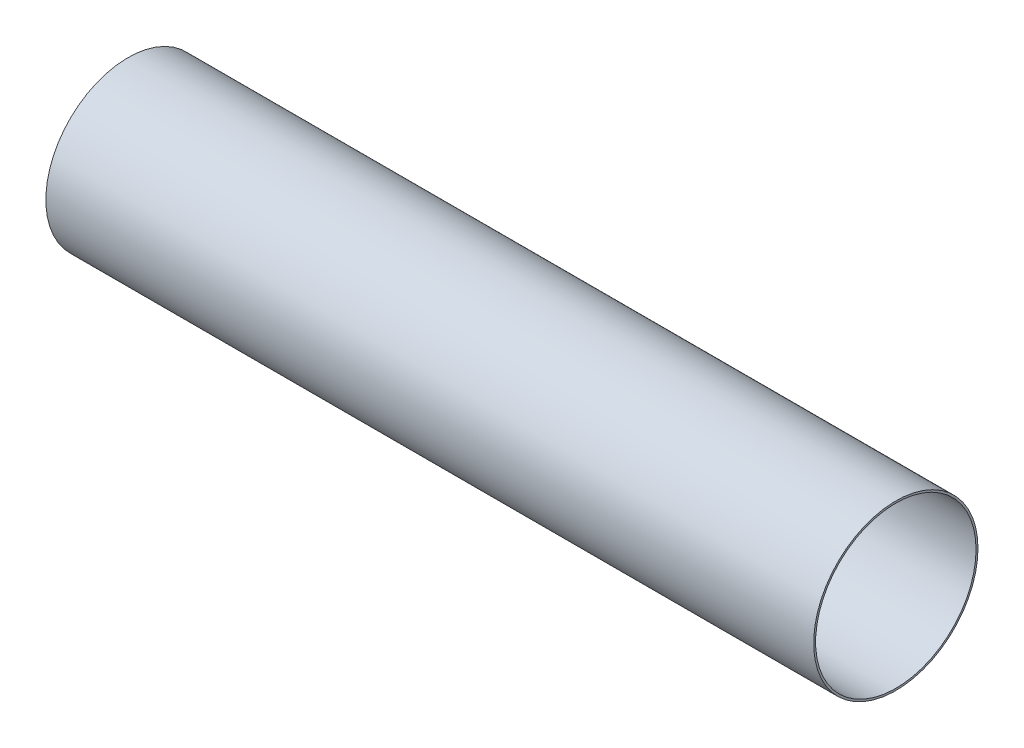
ISO-10303-21;
HEADER;
FILE_DESCRIPTION(('STEP AP214'),'2;1');
FILE_NAME('part.step','',(''),(''),'','','');
FILE_SCHEMA(('AUTOMOTIVE_DESIGN { 1 0 10303 214 1 1 1 1 }'));
ENDSEC;
DATA;
#1=APPLICATION_CONTEXT('core data for automotive mechanical design processes');
#2=APPLICATION_PROTOCOL_DEFINITION('international standard','automotive_design',2000,#1);
#3=PRODUCT_CONTEXT('',#1,'mechanical');
#4=PRODUCT('Part','Part','',(#3));
#5=PRODUCT_RELATED_PRODUCT_CATEGORY('part','',(#4));
#6=PRODUCT_DEFINITION_FORMATION('','',#4);
#7=PRODUCT_DEFINITION_CONTEXT('part definition',#1,'design');
#8=PRODUCT_DEFINITION('design','',#6,#7);
#9=PRODUCT_DEFINITION_SHAPE('','',#8);
#10=(LENGTH_UNIT() NAMED_UNIT(*) SI_UNIT(.MILLI.,.METRE.));
#11=(NAMED_UNIT(*) PLANE_ANGLE_UNIT() SI_UNIT($,.RADIAN.));
#12=(NAMED_UNIT(*) SI_UNIT($,.STERADIAN.) SOLID_ANGLE_UNIT());
#13=UNCERTAINTY_MEASURE_WITH_UNIT(LENGTH_MEASURE(1.E-05),#10,'distance_accuracy_value','');
#14=(GEOMETRIC_REPRESENTATION_CONTEXT(3) GLOBAL_UNCERTAINTY_ASSIGNED_CONTEXT((#13)) GLOBAL_UNIT_ASSIGNED_CONTEXT((#10,
#11,#12)) REPRESENTATION_CONTEXT('',''));
#15=CARTESIAN_POINT('',(0.,0.,0.));
#16=DIRECTION('',(0.,0.,1.));
#17=DIRECTION('',(1.,0.,0.));
#18=AXIS2_PLACEMENT_3D('',#15,#16,#17);
#19=CARTESIAN_POINT('',(790.,0.,0.));
#20=DIRECTION('',(-1.,0.,0.));
#21=DIRECTION('',(0.,0.,1.));
#22=AXIS2_PLACEMENT_3D('',#19,#20,#21);
#23=CYLINDRICAL_SURFACE('',#22,84.55);
#24=CARTESIAN_POINT('',(790.,0.,0.));
#25=DIRECTION('',(1.,0.,0.));
#26=DIRECTION('',(0.,0.,-1.));
#27=AXIS2_PLACEMENT_3D('',#24,#25,#26);
#28=CIRCLE('',#27,84.55);
#29=CARTESIAN_POINT('',(790.,0.,-84.55));
#30=VERTEX_POINT('',#29);
#31=EDGE_CURVE('E10',#30,#30,#28,.T.);
#32=ORIENTED_EDGE('',*,*,#31,.F.);
#33=EDGE_LOOP('',(#32));
#34=FACE_BOUND('',#33,.T.);
#35=CARTESIAN_POINT('',(0.,0.,0.));
#36=DIRECTION('',(1.,0.,0.));
#37=DIRECTION('',(0.,0.,-1.));
#38=AXIS2_PLACEMENT_3D('',#35,#36,#37);
#39=CIRCLE('',#38,84.55);
#40=CARTESIAN_POINT('',(0.,0.,-84.55));
#41=VERTEX_POINT('',#40);
#42=EDGE_CURVE('E40',#41,#41,#39,.T.);
#43=ORIENTED_EDGE('',*,*,#42,.T.);
#44=EDGE_LOOP('',(#43));
#45=FACE_BOUND('',#44,.T.);
#46=ADVANCED_FACE('F33',(#34,#45),#23,.T.);
#47=CARTESIAN_POINT('',(790.,0.,0.));
#48=DIRECTION('',(1.,0.,0.));
#49=DIRECTION('',(0.,0.,-1.));
#50=AXIS2_PLACEMENT_3D('',#47,#48,#49);
#51=PLANE('',#50);
#52=CARTESIAN_POINT('',(790.,0.,0.));
#53=DIRECTION('',(1.,0.,0.));
#54=DIRECTION('',(0.,0.,-1.));
#55=AXIS2_PLACEMENT_3D('',#52,#53,#54);
#56=CIRCLE('',#55,82.55);
#57=CARTESIAN_POINT('',(790.,0.,-82.55));
#58=VERTEX_POINT('',#57);
#59=EDGE_CURVE('E46',#58,#58,#56,.T.);
#60=ORIENTED_EDGE('',*,*,#59,.F.);
#61=EDGE_LOOP('',(#60));
#62=FACE_BOUND('',#61,.T.);
#63=ORIENTED_EDGE('',*,*,#31,.T.);
#64=EDGE_LOOP('',(#63));
#65=FACE_BOUND('',#64,.T.);
#66=ADVANCED_FACE('F62',(#62,#65),#51,.T.);
#67=CARTESIAN_POINT('',(0.,0.,0.));
#68=DIRECTION('',(1.,0.,0.));
#69=DIRECTION('',(0.,0.,-1.));
#70=AXIS2_PLACEMENT_3D('',#67,#68,#69);
#71=PLANE('',#70);
#72=CARTESIAN_POINT('',(0.,0.,0.));
#73=DIRECTION('',(1.,0.,0.));
#74=DIRECTION('',(0.,0.,-1.));
#75=AXIS2_PLACEMENT_3D('',#72,#73,#74);
#76=CIRCLE('',#75,82.55);
#77=CARTESIAN_POINT('',(0.,0.,-82.55));
#78=VERTEX_POINT('',#77);
#79=EDGE_CURVE('E36',#78,#78,#76,.T.);
#80=ORIENTED_EDGE('',*,*,#79,.T.);
#81=EDGE_LOOP('',(#80));
#82=FACE_BOUND('',#81,.T.);
#83=ORIENTED_EDGE('',*,*,#42,.F.);
#84=EDGE_LOOP('',(#83));
#85=FACE_BOUND('',#84,.T.);
#86=ADVANCED_FACE('F53',(#82,#85),#71,.F.);
#87=CARTESIAN_POINT('',(-150.,0.,0.));
#88=DIRECTION('',(1.,0.,0.));
#89=DIRECTION('',(0.,0.,-1.));
#90=AXIS2_PLACEMENT_3D('',#87,#88,#89);
#91=CYLINDRICAL_SURFACE('',#90,82.55);
#92=ORIENTED_EDGE('',*,*,#59,.T.);
#93=EDGE_LOOP('',(#92));
#94=FACE_BOUND('',#93,.T.);
#95=ORIENTED_EDGE('',*,*,#79,.F.);
#96=EDGE_LOOP('',(#95));
#97=FACE_BOUND('',#96,.T.);
#98=ADVANCED_FACE('F56',(#94,#97),#91,.F.);
#99=CLOSED_SHELL('',(#46,#66,#86,#98));
#100=MANIFOLD_SOLID_BREP('B2',#99);
#101=ADVANCED_BREP_SHAPE_REPRESENTATION('',(#18,#100),#14);
#102=SHAPE_DEFINITION_REPRESENTATION(#9,#101);
ENDSEC;
END-ISO-10303-21;
